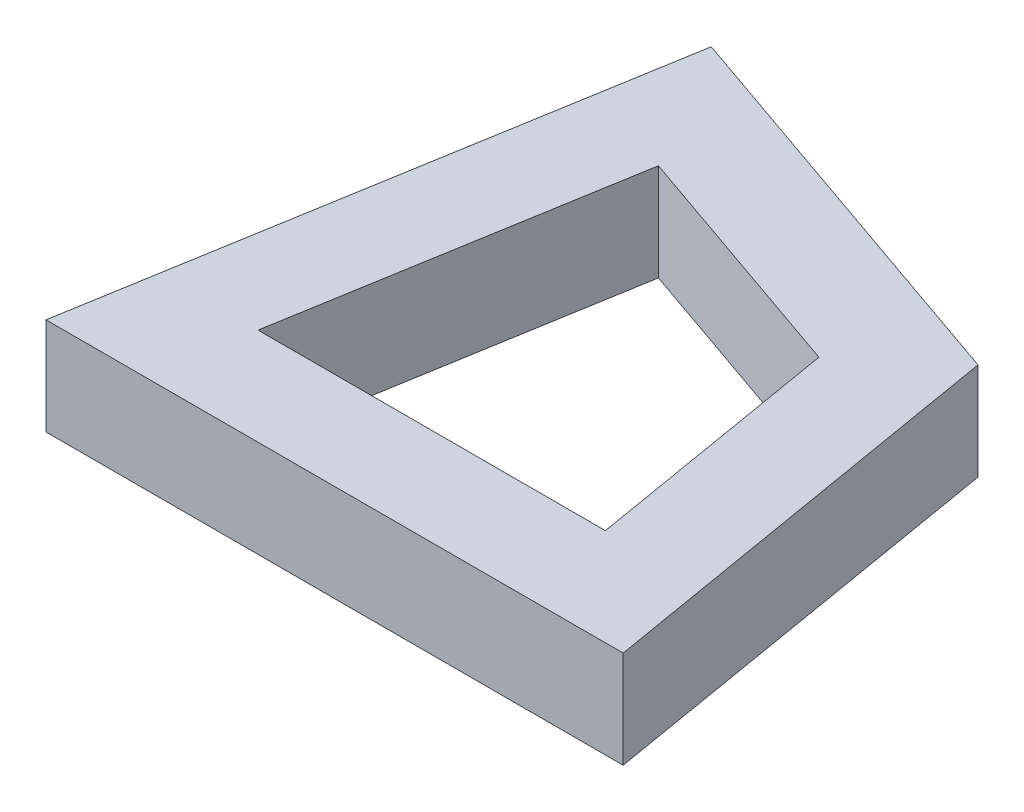
ISO-10303-21;
HEADER;
FILE_DESCRIPTION(('STEP AP214'),'2;1');
FILE_NAME('part.step','',(''),(''),'','','');
FILE_SCHEMA(('AUTOMOTIVE_DESIGN { 1 0 10303 214 1 1 1 1 }'));
ENDSEC;
DATA;
#1=APPLICATION_CONTEXT('core data for automotive mechanical design processes');
#2=APPLICATION_PROTOCOL_DEFINITION('international standard','automotive_design',2000,#1);
#3=PRODUCT_CONTEXT('',#1,'mechanical');
#4=PRODUCT('Part','Part','',(#3));
#5=PRODUCT_RELATED_PRODUCT_CATEGORY('part','',(#4));
#6=PRODUCT_DEFINITION_FORMATION('','',#4);
#7=PRODUCT_DEFINITION_CONTEXT('part definition',#1,'design');
#8=PRODUCT_DEFINITION('design','',#6,#7);
#9=PRODUCT_DEFINITION_SHAPE('','',#8);
#10=(LENGTH_UNIT() NAMED_UNIT(*) SI_UNIT(.MILLI.,.METRE.));
#11=(NAMED_UNIT(*) PLANE_ANGLE_UNIT() SI_UNIT($,.RADIAN.));
#12=(NAMED_UNIT(*) SI_UNIT($,.STERADIAN.) SOLID_ANGLE_UNIT());
#13=UNCERTAINTY_MEASURE_WITH_UNIT(LENGTH_MEASURE(1.E-05),#10,'distance_accuracy_value','');
#14=(GEOMETRIC_REPRESENTATION_CONTEXT(3) GLOBAL_UNCERTAINTY_ASSIGNED_CONTEXT((#13)) GLOBAL_UNIT_ASSIGNED_CONTEXT((#10,
#11,#12)) REPRESENTATION_CONTEXT('',''));
#15=CARTESIAN_POINT('',(0.,0.,0.));
#16=DIRECTION('',(0.,0.,1.));
#17=DIRECTION('',(1.,0.,0.));
#18=AXIS2_PLACEMENT_3D('',#15,#16,#17);
#19=CARTESIAN_POINT('',(0.,2.,0.));
#20=DIRECTION('',(0.,-1.,0.));
#21=DIRECTION('',(0.,0.,-1.));
#22=AXIS2_PLACEMENT_3D('',#19,#20,#21);
#23=PLANE('',#22);
#24=DIRECTION('',(-0.166596655404362,0.,0.986025128689974));
#25=VECTOR('',#24,1.);
#26=CARTESIAN_POINT('',(1.97990562300064,2.,-11.7183426760565));
#27=LINE('',#26,#25);
#28=CARTESIAN_POINT('',(1.97990562300064,2.,-11.7183426760565));
#29=VERTEX_POINT('',#28);
#30=CARTESIAN_POINT('',(0.,2.,0.));
#31=VERTEX_POINT('',#30);
#32=EDGE_CURVE('E140',#29,#31,#27,.T.);
#33=ORIENTED_EDGE('',*,*,#32,.T.);
#34=DIRECTION('',(1.,0.,0.));
#35=VECTOR('',#34,1.);
#36=CARTESIAN_POINT('',(0.,2.,0.));
#37=LINE('',#36,#35);
#38=CARTESIAN_POINT('',(11.884426,2.,0.));
#39=VERTEX_POINT('',#38);
#40=EDGE_CURVE('E143',#31,#39,#37,.T.);
#41=ORIENTED_EDGE('',*,*,#40,.T.);
#42=DIRECTION('',(-0.166596655404362,0.,-0.986025128689974));
#43=VECTOR('',#42,1.);
#44=CARTESIAN_POINT('',(11.884426,2.,0.));
#45=LINE('',#44,#43);
#46=CARTESIAN_POINT('',(10.3990167289282,2.,-8.79159827135121));
#47=VERTEX_POINT('',#46);
#48=EDGE_CURVE('E146',#39,#47,#45,.T.);
#49=ORIENTED_EDGE('',*,*,#48,.T.);
#50=DIRECTION('',(-0.944553945341675,0.,-0.328356276534311));
#51=VECTOR('',#50,1.);
#52=CARTESIAN_POINT('',(10.3990167289282,2.,-8.79159827135121));
#53=LINE('',#52,#51);
#54=EDGE_CURVE('E148',#47,#29,#53,.T.);
#55=ORIENTED_EDGE('',*,*,#54,.T.);
#56=EDGE_LOOP('',(#33,#41,#49,#55));
#57=FACE_BOUND('',#56,.T.);
#58=DIRECTION('',(-0.944553945341675,0.,-0.328356276534311));
#59=VECTOR('',#58,1.);
#60=CARTESIAN_POINT('',(8.62417723858412,2.,-7.2911860180395));
#61=LINE('',#60,#59);
#62=CARTESIAN_POINT('',(8.62417723858412,2.,-7.2911860180395));
#63=VERTEX_POINT('',#62);
#64=CARTESIAN_POINT('',(3.55782110533023,2.,-9.052408702796));
#65=VERTEX_POINT('',#64);
#66=EDGE_CURVE('E104',#63,#65,#61,.T.);
#67=ORIENTED_EDGE('',*,*,#66,.F.);
#68=DIRECTION('',(-0.166596655404361,0.,-0.986025128689974));
#69=VECTOR('',#68,1.);
#70=CARTESIAN_POINT('',(9.51816448909045,2.,-2.));
#71=LINE('',#70,#69);
#72=CARTESIAN_POINT('',(9.51816448909045,2.,-2.));
#73=VERTEX_POINT('',#72);
#74=EDGE_CURVE('E126',#73,#63,#71,.T.);
#75=ORIENTED_EDGE('',*,*,#74,.F.);
#76=DIRECTION('',(1.,0.,0.));
#77=VECTOR('',#76,1.);
#78=CARTESIAN_POINT('',(2.36626151090955,2.,-2.));
#79=LINE('',#78,#77);
#80=CARTESIAN_POINT('',(2.36626151090955,2.,-2.));
#81=VERTEX_POINT('',#80);
#82=EDGE_CURVE('E124',#81,#73,#79,.T.);
#83=ORIENTED_EDGE('',*,*,#82,.F.);
#84=DIRECTION('',(-0.166596655404362,0.,0.986025128689974));
#85=VECTOR('',#84,1.);
#86=CARTESIAN_POINT('',(3.55782110533023,2.,-9.052408702796));
#87=LINE('',#86,#85);
#88=EDGE_CURVE('E112',#65,#81,#87,.T.);
#89=ORIENTED_EDGE('',*,*,#88,.F.);
#90=EDGE_LOOP('',(#67,#75,#83,#89));
#91=FACE_BOUND('',#90,.T.);
#92=ADVANCED_FACE('F39',(#57,#91),#23,.F.);
#93=CARTESIAN_POINT('',(0.,0.,0.));
#94=DIRECTION('',(0.,-1.,0.));
#95=DIRECTION('',(0.,0.,-1.));
#96=AXIS2_PLACEMENT_3D('',#93,#94,#95);
#97=PLANE('',#96);
#98=DIRECTION('',(-0.166596655404362,0.,0.986025128689974));
#99=VECTOR('',#98,1.);
#100=CARTESIAN_POINT('',(1.97990562300064,0.,-11.7183426760565));
#101=LINE('',#100,#99);
#102=CARTESIAN_POINT('',(1.97990562300064,0.,-11.7183426760565));
#103=VERTEX_POINT('',#102);
#104=CARTESIAN_POINT('',(0.,0.,0.));
#105=VERTEX_POINT('',#104);
#106=EDGE_CURVE('E120',#103,#105,#101,.T.);
#107=ORIENTED_EDGE('',*,*,#106,.F.);
#108=DIRECTION('',(-0.944553945341675,0.,-0.328356276534311));
#109=VECTOR('',#108,1.);
#110=CARTESIAN_POINT('',(10.3990167289282,0.,-8.79159827135121));
#111=LINE('',#110,#109);
#112=CARTESIAN_POINT('',(10.3990167289282,0.,-8.79159827135121));
#113=VERTEX_POINT('',#112);
#114=EDGE_CURVE('E144',#113,#103,#111,.T.);
#115=ORIENTED_EDGE('',*,*,#114,.F.);
#116=DIRECTION('',(-0.166596655404362,0.,-0.986025128689974));
#117=VECTOR('',#116,1.);
#118=CARTESIAN_POINT('',(11.884426,0.,0.));
#119=LINE('',#118,#117);
#120=CARTESIAN_POINT('',(11.884426,0.,0.));
#121=VERTEX_POINT('',#120);
#122=EDGE_CURVE('E155',#121,#113,#119,.T.);
#123=ORIENTED_EDGE('',*,*,#122,.F.);
#124=DIRECTION('',(1.,0.,0.));
#125=VECTOR('',#124,1.);
#126=CARTESIAN_POINT('',(0.,0.,0.));
#127=LINE('',#126,#125);
#128=EDGE_CURVE('E153',#105,#121,#127,.T.);
#129=ORIENTED_EDGE('',*,*,#128,.F.);
#130=EDGE_LOOP('',(#107,#115,#123,#129));
#131=FACE_BOUND('',#130,.T.);
#132=DIRECTION('',(-0.166596655404361,0.,-0.986025128689974));
#133=VECTOR('',#132,1.);
#134=CARTESIAN_POINT('',(9.51816448909045,0.,-2.));
#135=LINE('',#134,#133);
#136=CARTESIAN_POINT('',(9.51816448909045,0.,-2.));
#137=VERTEX_POINT('',#136);
#138=CARTESIAN_POINT('',(8.62417723858412,0.,-7.2911860180395));
#139=VERTEX_POINT('',#138);
#140=EDGE_CURVE('E113',#137,#139,#135,.T.);
#141=ORIENTED_EDGE('',*,*,#140,.T.);
#142=DIRECTION('',(-0.944553945341675,0.,-0.328356276534311));
#143=VECTOR('',#142,1.);
#144=CARTESIAN_POINT('',(8.62417723858412,0.,-7.2911860180395));
#145=LINE('',#144,#143);
#146=CARTESIAN_POINT('',(3.55782110533023,0.,-9.052408702796));
#147=VERTEX_POINT('',#146);
#148=EDGE_CURVE('E62',#139,#147,#145,.T.);
#149=ORIENTED_EDGE('',*,*,#148,.T.);
#150=DIRECTION('',(-0.166596655404362,0.,0.986025128689974));
#151=VECTOR('',#150,1.);
#152=CARTESIAN_POINT('',(3.55782110533023,0.,-9.052408702796));
#153=LINE('',#152,#151);
#154=CARTESIAN_POINT('',(2.36626151090955,0.,-2.));
#155=VERTEX_POINT('',#154);
#156=EDGE_CURVE('E119',#147,#155,#153,.T.);
#157=ORIENTED_EDGE('',*,*,#156,.T.);
#158=DIRECTION('',(1.,0.,0.));
#159=VECTOR('',#158,1.);
#160=CARTESIAN_POINT('',(2.36626151090955,0.,-2.));
#161=LINE('',#160,#159);
#162=EDGE_CURVE('E132',#155,#137,#161,.T.);
#163=ORIENTED_EDGE('',*,*,#162,.T.);
#164=EDGE_LOOP('',(#141,#149,#157,#163));
#165=FACE_BOUND('',#164,.T.);
#166=ADVANCED_FACE('F173',(#131,#165),#97,.T.);
#167=CARTESIAN_POINT('',(1.97990562300064,2.,-11.7183426760565));
#168=DIRECTION('',(0.986025128689974,0.,0.166596655404362));
#169=DIRECTION('',(0.166596655404362,0.,-0.986025128689974));
#170=AXIS2_PLACEMENT_3D('',#167,#168,#169);
#171=PLANE('',#170);
#172=ORIENTED_EDGE('',*,*,#106,.T.);
#173=DIRECTION('',(0.,-1.,0.));
#174=VECTOR('',#173,1.);
#175=CARTESIAN_POINT('',(0.,2.,0.));
#176=LINE('',#175,#174);
#177=EDGE_CURVE('E11',#31,#105,#176,.T.);
#178=ORIENTED_EDGE('',*,*,#177,.F.);
#179=ORIENTED_EDGE('',*,*,#32,.F.);
#180=DIRECTION('',(0.,-1.,0.));
#181=VECTOR('',#180,1.);
#182=CARTESIAN_POINT('',(1.97990562300064,2.,-11.7183426760565));
#183=LINE('',#182,#181);
#184=EDGE_CURVE('E150',#29,#103,#183,.T.);
#185=ORIENTED_EDGE('',*,*,#184,.T.);
#186=EDGE_LOOP('',(#172,#178,#179,#185));
#187=FACE_BOUND('',#186,.T.);
#188=ADVANCED_FACE('F41',(#187),#171,.F.);
#189=CARTESIAN_POINT('',(0.,2.,0.));
#190=DIRECTION('',(0.,0.,-1.));
#191=DIRECTION('',(-1.,0.,0.));
#192=AXIS2_PLACEMENT_3D('',#189,#190,#191);
#193=PLANE('',#192);
#194=ORIENTED_EDGE('',*,*,#128,.T.);
#195=DIRECTION('',(0.,-1.,0.));
#196=VECTOR('',#195,1.);
#197=CARTESIAN_POINT('',(11.884426,2.,0.));
#198=LINE('',#197,#196);
#199=EDGE_CURVE('E47',#39,#121,#198,.T.);
#200=ORIENTED_EDGE('',*,*,#199,.F.);
#201=ORIENTED_EDGE('',*,*,#40,.F.);
#202=ORIENTED_EDGE('',*,*,#177,.T.);
#203=EDGE_LOOP('',(#194,#200,#201,#202));
#204=FACE_BOUND('',#203,.T.);
#205=ADVANCED_FACE('F183',(#204),#193,.F.);
#206=CARTESIAN_POINT('',(11.884426,2.,0.));
#207=DIRECTION('',(-0.986025128689974,0.,0.166596655404362));
#208=DIRECTION('',(0.166596655404362,0.,0.986025128689974));
#209=AXIS2_PLACEMENT_3D('',#206,#207,#208);
#210=PLANE('',#209);
#211=ORIENTED_EDGE('',*,*,#122,.T.);
#212=DIRECTION('',(0.,-1.,0.));
#213=VECTOR('',#212,1.);
#214=CARTESIAN_POINT('',(10.3990167289282,2.,-8.79159827135121));
#215=LINE('',#214,#213);
#216=EDGE_CURVE('E160',#47,#113,#215,.T.);
#217=ORIENTED_EDGE('',*,*,#216,.F.);
#218=ORIENTED_EDGE('',*,*,#48,.F.);
#219=ORIENTED_EDGE('',*,*,#199,.T.);
#220=EDGE_LOOP('',(#211,#217,#218,#219));
#221=FACE_BOUND('',#220,.T.);
#222=ADVANCED_FACE('F167',(#221),#210,.F.);
#223=CARTESIAN_POINT('',(10.3990167289282,2.,-8.79159827135121));
#224=DIRECTION('',(-0.328356276534311,0.,0.944553945341675));
#225=DIRECTION('',(0.944553945341675,0.,0.328356276534311));
#226=AXIS2_PLACEMENT_3D('',#223,#224,#225);
#227=PLANE('',#226);
#228=ORIENTED_EDGE('',*,*,#114,.T.);
#229=ORIENTED_EDGE('',*,*,#184,.F.);
#230=ORIENTED_EDGE('',*,*,#54,.F.);
#231=ORIENTED_EDGE('',*,*,#216,.T.);
#232=EDGE_LOOP('',(#228,#229,#230,#231));
#233=FACE_BOUND('',#232,.T.);
#234=ADVANCED_FACE('F177',(#233),#227,.F.);
#235=CARTESIAN_POINT('',(8.62417723858412,2.,-7.2911860180395));
#236=DIRECTION('',(-0.328356276534311,0.,0.944553945341675));
#237=DIRECTION('',(0.944553945341675,0.,0.328356276534311));
#238=AXIS2_PLACEMENT_3D('',#235,#236,#237);
#239=PLANE('',#238);
#240=ORIENTED_EDGE('',*,*,#148,.F.);
#241=DIRECTION('',(0.,-1.,0.));
#242=VECTOR('',#241,1.);
#243=CARTESIAN_POINT('',(8.62417723858412,2.,-7.2911860180395));
#244=LINE('',#243,#242);
#245=EDGE_CURVE('E108',#63,#139,#244,.T.);
#246=ORIENTED_EDGE('',*,*,#245,.F.);
#247=ORIENTED_EDGE('',*,*,#66,.T.);
#248=DIRECTION('',(0.,-1.,0.));
#249=VECTOR('',#248,1.);
#250=CARTESIAN_POINT('',(3.55782110533023,2.,-9.052408702796));
#251=LINE('',#250,#249);
#252=EDGE_CURVE('E107',#65,#147,#251,.T.);
#253=ORIENTED_EDGE('',*,*,#252,.T.);
#254=EDGE_LOOP('',(#240,#246,#247,#253));
#255=FACE_BOUND('',#254,.T.);
#256=ADVANCED_FACE('F106',(#255),#239,.T.);
#257=CARTESIAN_POINT('',(3.55782110533023,2.,-9.052408702796));
#258=DIRECTION('',(0.986025128689974,0.,0.166596655404362));
#259=DIRECTION('',(0.166596655404362,0.,-0.986025128689974));
#260=AXIS2_PLACEMENT_3D('',#257,#258,#259);
#261=PLANE('',#260);
#262=ORIENTED_EDGE('',*,*,#156,.F.);
#263=ORIENTED_EDGE('',*,*,#252,.F.);
#264=ORIENTED_EDGE('',*,*,#88,.T.);
#265=DIRECTION('',(0.,-1.,0.));
#266=VECTOR('',#265,1.);
#267=CARTESIAN_POINT('',(2.36626151090955,2.,-2.));
#268=LINE('',#267,#266);
#269=EDGE_CURVE('E121',#81,#155,#268,.T.);
#270=ORIENTED_EDGE('',*,*,#269,.T.);
#271=EDGE_LOOP('',(#262,#263,#264,#270));
#272=FACE_BOUND('',#271,.T.);
#273=ADVANCED_FACE('F116',(#272),#261,.T.);
#274=CARTESIAN_POINT('',(2.36626151090955,2.,-2.));
#275=DIRECTION('',(0.,0.,-1.));
#276=DIRECTION('',(-1.,0.,0.));
#277=AXIS2_PLACEMENT_3D('',#274,#275,#276);
#278=PLANE('',#277);
#279=ORIENTED_EDGE('',*,*,#162,.F.);
#280=ORIENTED_EDGE('',*,*,#269,.F.);
#281=ORIENTED_EDGE('',*,*,#82,.T.);
#282=DIRECTION('',(0.,-1.,0.));
#283=VECTOR('',#282,1.);
#284=CARTESIAN_POINT('',(9.51816448909045,2.,-2.));
#285=LINE('',#284,#283);
#286=EDGE_CURVE('E54',#73,#137,#285,.T.);
#287=ORIENTED_EDGE('',*,*,#286,.T.);
#288=EDGE_LOOP('',(#279,#280,#281,#287));
#289=FACE_BOUND('',#288,.T.);
#290=ADVANCED_FACE('F206',(#289),#278,.T.);
#291=CARTESIAN_POINT('',(9.51816448909045,2.,-2.));
#292=DIRECTION('',(-0.986025128689974,0.,0.166596655404361));
#293=DIRECTION('',(0.166596655404361,0.,0.986025128689974));
#294=AXIS2_PLACEMENT_3D('',#291,#292,#293);
#295=PLANE('',#294);
#296=ORIENTED_EDGE('',*,*,#140,.F.);
#297=ORIENTED_EDGE('',*,*,#286,.F.);
#298=ORIENTED_EDGE('',*,*,#74,.T.);
#299=ORIENTED_EDGE('',*,*,#245,.T.);
#300=EDGE_LOOP('',(#296,#297,#298,#299));
#301=FACE_BOUND('',#300,.T.);
#302=ADVANCED_FACE('F210',(#301),#295,.T.);
#303=CLOSED_SHELL('',(#92,#166,#188,#205,#222,#234,#256,#273,#290,#302));
#304=MANIFOLD_SOLID_BREP('B2',#303);
#305=ADVANCED_BREP_SHAPE_REPRESENTATION('',(#18,#304),#14);
#306=SHAPE_DEFINITION_REPRESENTATION(#9,#305);
ENDSEC;
END-ISO-10303-21;
